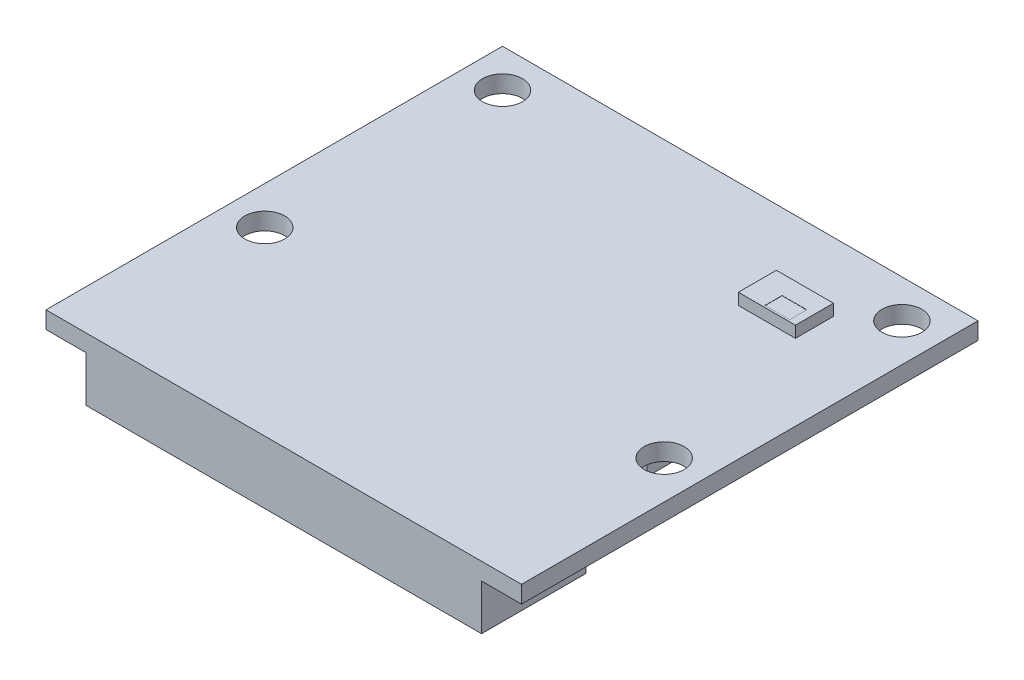
ISO-10303-21;
HEADER;
FILE_DESCRIPTION(('STEP AP214'),'2;1');
FILE_NAME('part.step','',(''),(''),'','','');
FILE_SCHEMA(('AUTOMOTIVE_DESIGN { 1 0 10303 214 1 1 1 1 }'));
ENDSEC;
DATA;
#1=APPLICATION_CONTEXT('core data for automotive mechanical design processes');
#2=APPLICATION_PROTOCOL_DEFINITION('international standard','automotive_design',2000,#1);
#3=PRODUCT_CONTEXT('',#1,'mechanical');
#4=PRODUCT('Part','Part','',(#3));
#5=PRODUCT_RELATED_PRODUCT_CATEGORY('part','',(#4));
#6=PRODUCT_DEFINITION_FORMATION('','',#4);
#7=PRODUCT_DEFINITION_CONTEXT('part definition',#1,'design');
#8=PRODUCT_DEFINITION('design','',#6,#7);
#9=PRODUCT_DEFINITION_SHAPE('','',#8);
#10=(LENGTH_UNIT() NAMED_UNIT(*) SI_UNIT(.MILLI.,.METRE.));
#11=(NAMED_UNIT(*) PLANE_ANGLE_UNIT() SI_UNIT($,.RADIAN.));
#12=(NAMED_UNIT(*) SI_UNIT($,.STERADIAN.) SOLID_ANGLE_UNIT());
#13=UNCERTAINTY_MEASURE_WITH_UNIT(LENGTH_MEASURE(1.E-05),#10,'distance_accuracy_value','');
#14=(GEOMETRIC_REPRESENTATION_CONTEXT(3) GLOBAL_UNCERTAINTY_ASSIGNED_CONTEXT((#13)) GLOBAL_UNIT_ASSIGNED_CONTEXT((#10,
#11,#12)) REPRESENTATION_CONTEXT('',''));
#15=CARTESIAN_POINT('',(0.,0.,0.));
#16=DIRECTION('',(0.,0.,1.));
#17=DIRECTION('',(1.,0.,0.));
#18=AXIS2_PLACEMENT_3D('',#15,#16,#17);
#19=CARTESIAN_POINT('',(0.,0.,0.));
#20=DIRECTION('',(0.,1.,0.));
#21=DIRECTION('',(0.,0.,1.));
#22=AXIS2_PLACEMENT_3D('',#19,#20,#21);
#23=PLANE('',#22);
#24=CARTESIAN_POINT('',(-10.5,0.,-12.5));
#25=DIRECTION('',(0.,1.,0.));
#26=DIRECTION('',(0.,0.,-1.));
#27=AXIS2_PLACEMENT_3D('',#24,#25,#26);
#28=CIRCLE('',#27,1.05);
#29=CARTESIAN_POINT('',(-10.5,0.,-13.55));
#30=VERTEX_POINT('',#29);
#31=EDGE_CURVE('E376',#30,#30,#28,.T.);
#32=ORIENTED_EDGE('',*,*,#31,.F.);
#33=EDGE_LOOP('',(#32));
#34=FACE_BOUND('',#33,.T.);
#35=CARTESIAN_POINT('',(-10.5,0.,0.));
#36=DIRECTION('',(0.,1.,0.));
#37=DIRECTION('',(0.,0.,-1.));
#38=AXIS2_PLACEMENT_3D('',#35,#36,#37);
#39=CIRCLE('',#38,1.05);
#40=CARTESIAN_POINT('',(-10.5,0.,-1.05));
#41=VERTEX_POINT('',#40);
#42=EDGE_CURVE('E382',#41,#41,#39,.T.);
#43=ORIENTED_EDGE('',*,*,#42,.F.);
#44=EDGE_LOOP('',(#43));
#45=FACE_BOUND('',#44,.T.);
#46=CARTESIAN_POINT('',(10.5,0.,0.));
#47=DIRECTION('',(0.,1.,0.));
#48=DIRECTION('',(0.,0.,1.));
#49=AXIS2_PLACEMENT_3D('',#46,#47,#48);
#50=CIRCLE('',#49,1.05);
#51=CARTESIAN_POINT('',(10.5,0.,1.05));
#52=VERTEX_POINT('',#51);
#53=EDGE_CURVE('E387',#52,#52,#50,.T.);
#54=ORIENTED_EDGE('',*,*,#53,.F.);
#55=EDGE_LOOP('',(#54));
#56=FACE_BOUND('',#55,.T.);
#57=CARTESIAN_POINT('',(10.5,0.,-12.5));
#58=DIRECTION('',(0.,1.,0.));
#59=DIRECTION('',(0.,0.,1.));
#60=AXIS2_PLACEMENT_3D('',#57,#58,#59);
#61=CIRCLE('',#60,1.05);
#62=CARTESIAN_POINT('',(10.5,0.,-11.45));
#63=VERTEX_POINT('',#62);
#64=EDGE_CURVE('E393',#63,#63,#61,.T.);
#65=ORIENTED_EDGE('',*,*,#64,.F.);
#66=EDGE_LOOP('',(#65));
#67=FACE_BOUND('',#66,.T.);
#68=DIRECTION('',(0.,0.,1.));
#69=VECTOR('',#68,1.);
#70=CARTESIAN_POINT('',(-12.5,0.,-14.5));
#71=LINE('',#70,#69);
#72=CARTESIAN_POINT('',(-12.5,0.,-14.5));
#73=VERTEX_POINT('',#72);
#74=CARTESIAN_POINT('',(-12.5,0.,9.5));
#75=VERTEX_POINT('',#74);
#76=EDGE_CURVE('E330',#73,#75,#71,.T.);
#77=ORIENTED_EDGE('',*,*,#76,.T.);
#78=DIRECTION('',(1.,0.,0.));
#79=VECTOR('',#78,1.);
#80=CARTESIAN_POINT('',(-12.5,0.,9.5));
#81=LINE('',#80,#79);
#82=CARTESIAN_POINT('',(12.5,0.,9.5));
#83=VERTEX_POINT('',#82);
#84=EDGE_CURVE('E333',#75,#83,#81,.T.);
#85=ORIENTED_EDGE('',*,*,#84,.T.);
#86=DIRECTION('',(0.,0.,-1.));
#87=VECTOR('',#86,1.);
#88=CARTESIAN_POINT('',(12.5,0.,-14.5));
#89=LINE('',#88,#87);
#90=CARTESIAN_POINT('',(12.5,0.,-14.5));
#91=VERTEX_POINT('',#90);
#92=EDGE_CURVE('E337',#83,#91,#89,.T.);
#93=ORIENTED_EDGE('',*,*,#92,.T.);
#94=DIRECTION('',(-1.,0.,0.));
#95=VECTOR('',#94,1.);
#96=CARTESIAN_POINT('',(-12.5,0.,-14.5));
#97=LINE('',#96,#95);
#98=EDGE_CURVE('E340',#91,#73,#97,.T.);
#99=ORIENTED_EDGE('',*,*,#98,.T.);
#100=EDGE_LOOP('',(#77,#85,#93,#99));
#101=FACE_BOUND('',#100,.T.);
#102=DIRECTION('',(1.,0.,0.));
#103=VECTOR('',#102,1.);
#104=CARTESIAN_POINT('',(5.5,0.,-8.90000000000001));
#105=LINE('',#104,#103);
#106=CARTESIAN_POINT('',(5.5,0.,-8.90000000000001));
#107=VERTEX_POINT('',#106);
#108=CARTESIAN_POINT('',(8.5,0.,-8.90000000000001));
#109=VERTEX_POINT('',#108);
#110=EDGE_CURVE('E226',#107,#109,#105,.T.);
#111=ORIENTED_EDGE('',*,*,#110,.F.);
#112=DIRECTION('',(0.,0.,1.));
#113=VECTOR('',#112,1.);
#114=CARTESIAN_POINT('',(5.5,0.,-10.9));
#115=LINE('',#114,#113);
#116=CARTESIAN_POINT('',(5.5,0.,-10.9));
#117=VERTEX_POINT('',#116);
#118=EDGE_CURVE('E209',#117,#107,#115,.T.);
#119=ORIENTED_EDGE('',*,*,#118,.F.);
#120=DIRECTION('',(-1.,0.,0.));
#121=VECTOR('',#120,1.);
#122=CARTESIAN_POINT('',(5.5,0.,-10.9));
#123=LINE('',#122,#121);
#124=CARTESIAN_POINT('',(8.5,0.,-10.9));
#125=VERTEX_POINT('',#124);
#126=EDGE_CURVE('E217',#125,#117,#123,.T.);
#127=ORIENTED_EDGE('',*,*,#126,.F.);
#128=DIRECTION('',(0.,0.,-1.));
#129=VECTOR('',#128,1.);
#130=CARTESIAN_POINT('',(8.5,0.,-10.9));
#131=LINE('',#130,#129);
#132=EDGE_CURVE('E228',#109,#125,#131,.T.);
#133=ORIENTED_EDGE('',*,*,#132,.F.);
#134=EDGE_LOOP('',(#111,#119,#127,#133));
#135=FACE_BOUND('',#134,.T.);
#136=ADVANCED_FACE('F35',(#34,#45,#56,#67,#101,#135),#23,.T.);
#137=CARTESIAN_POINT('',(0.,-0.9,0.));
#138=DIRECTION('',(0.,1.,0.));
#139=DIRECTION('',(0.,0.,1.));
#140=AXIS2_PLACEMENT_3D('',#137,#138,#139);
#141=PLANE('',#140);
#142=DIRECTION('',(0.,0.,-1.));
#143=VECTOR('',#142,1.);
#144=CARTESIAN_POINT('',(-10.4,-0.9,9.5));
#145=LINE('',#144,#143);
#146=CARTESIAN_POINT('',(-10.4,-0.9,9.5));
#147=VERTEX_POINT('',#146);
#148=CARTESIAN_POINT('',(-10.4,-0.9,4.));
#149=VERTEX_POINT('',#148);
#150=EDGE_CURVE('E272',#147,#149,#145,.T.);
#151=ORIENTED_EDGE('',*,*,#150,.F.);
#152=DIRECTION('',(1.,0.,0.));
#153=VECTOR('',#152,1.);
#154=CARTESIAN_POINT('',(-12.5,-0.9,9.5));
#155=LINE('',#154,#153);
#156=CARTESIAN_POINT('',(-12.5,-0.9,9.5));
#157=VERTEX_POINT('',#156);
#158=EDGE_CURVE('E315',#157,#147,#155,.T.);
#159=ORIENTED_EDGE('',*,*,#158,.F.);
#160=DIRECTION('',(0.,0.,1.));
#161=VECTOR('',#160,1.);
#162=CARTESIAN_POINT('',(-12.5,-0.9,-14.5));
#163=LINE('',#162,#161);
#164=CARTESIAN_POINT('',(-12.5,-0.9,-14.5));
#165=VERTEX_POINT('',#164);
#166=EDGE_CURVE('E316',#165,#157,#163,.T.);
#167=ORIENTED_EDGE('',*,*,#166,.F.);
#168=DIRECTION('',(-1.,0.,0.));
#169=VECTOR('',#168,1.);
#170=CARTESIAN_POINT('',(-12.5,-0.9,-14.5));
#171=LINE('',#170,#169);
#172=CARTESIAN_POINT('',(12.5,-0.9,-14.5));
#173=VERTEX_POINT('',#172);
#174=EDGE_CURVE('E326',#173,#165,#171,.T.);
#175=ORIENTED_EDGE('',*,*,#174,.F.);
#176=DIRECTION('',(0.,0.,-1.));
#177=VECTOR('',#176,1.);
#178=CARTESIAN_POINT('',(12.5,-0.9,-14.5));
#179=LINE('',#178,#177);
#180=CARTESIAN_POINT('',(12.5,-0.9,9.5));
#181=VERTEX_POINT('',#180);
#182=EDGE_CURVE('E322',#181,#173,#179,.T.);
#183=ORIENTED_EDGE('',*,*,#182,.F.);
#184=CARTESIAN_POINT('',(10.4,-0.9,9.5));
#185=VERTEX_POINT('',#184);
#186=EDGE_CURVE('E312',#185,#181,#155,.T.);
#187=ORIENTED_EDGE('',*,*,#186,.F.);
#188=DIRECTION('',(0.,0.,1.));
#189=VECTOR('',#188,1.);
#190=CARTESIAN_POINT('',(10.4,-0.9,9.5));
#191=LINE('',#190,#189);
#192=CARTESIAN_POINT('',(10.4,-0.9,4.));
#193=VERTEX_POINT('',#192);
#194=EDGE_CURVE('E277',#193,#185,#191,.T.);
#195=ORIENTED_EDGE('',*,*,#194,.F.);
#196=DIRECTION('',(1.,0.,0.));
#197=VECTOR('',#196,1.);
#198=CARTESIAN_POINT('',(-10.4,-0.9,4.));
#199=LINE('',#198,#197);
#200=EDGE_CURVE('E284',#149,#193,#199,.T.);
#201=ORIENTED_EDGE('',*,*,#200,.F.);
#202=EDGE_LOOP('',(#151,#159,#167,#175,#183,#187,#195,#201));
#203=FACE_BOUND('',#202,.T.);
#204=CARTESIAN_POINT('',(-10.5,-0.9,-12.5));
#205=DIRECTION('',(0.,1.,0.));
#206=DIRECTION('',(0.,0.,-1.));
#207=AXIS2_PLACEMENT_3D('',#204,#205,#206);
#208=CIRCLE('',#207,1.05);
#209=CARTESIAN_POINT('',(-10.5,-0.9,-13.55));
#210=VERTEX_POINT('',#209);
#211=EDGE_CURVE('E378',#210,#210,#208,.T.);
#212=ORIENTED_EDGE('',*,*,#211,.T.);
#213=EDGE_LOOP('',(#212));
#214=FACE_BOUND('',#213,.T.);
#215=CARTESIAN_POINT('',(-10.5,-0.9,0.));
#216=DIRECTION('',(0.,1.,0.));
#217=DIRECTION('',(0.,0.,-1.));
#218=AXIS2_PLACEMENT_3D('',#215,#216,#217);
#219=CIRCLE('',#218,1.05);
#220=CARTESIAN_POINT('',(-10.5,-0.9,-1.05));
#221=VERTEX_POINT('',#220);
#222=EDGE_CURVE('E384',#221,#221,#219,.T.);
#223=ORIENTED_EDGE('',*,*,#222,.T.);
#224=EDGE_LOOP('',(#223));
#225=FACE_BOUND('',#224,.T.);
#226=CARTESIAN_POINT('',(10.5,-0.9,0.));
#227=DIRECTION('',(0.,1.,0.));
#228=DIRECTION('',(0.,0.,1.));
#229=AXIS2_PLACEMENT_3D('',#226,#227,#228);
#230=CIRCLE('',#229,1.05);
#231=CARTESIAN_POINT('',(10.5,-0.9,1.05));
#232=VERTEX_POINT('',#231);
#233=EDGE_CURVE('E390',#232,#232,#230,.T.);
#234=ORIENTED_EDGE('',*,*,#233,.T.);
#235=EDGE_LOOP('',(#234));
#236=FACE_BOUND('',#235,.T.);
#237=CARTESIAN_POINT('',(10.5,-0.9,-12.5));
#238=DIRECTION('',(0.,1.,0.));
#239=DIRECTION('',(0.,0.,1.));
#240=AXIS2_PLACEMENT_3D('',#237,#238,#239);
#241=CIRCLE('',#240,1.05);
#242=CARTESIAN_POINT('',(10.5,-0.9,-11.45));
#243=VERTEX_POINT('',#242);
#244=EDGE_CURVE('E334',#243,#243,#241,.T.);
#245=ORIENTED_EDGE('',*,*,#244,.T.);
#246=EDGE_LOOP('',(#245));
#247=FACE_BOUND('',#246,.T.);
#248=DIRECTION('',(0.,0.,-1.));
#249=VECTOR('',#248,1.);
#250=CARTESIAN_POINT('',(-9.,-0.9,-0.900000000000005));
#251=LINE('',#250,#249);
#252=CARTESIAN_POINT('',(-9.,-0.9,-0.900000000000005));
#253=VERTEX_POINT('',#252);
#254=CARTESIAN_POINT('',(-9.,-0.9,-12.5));
#255=VERTEX_POINT('',#254);
#256=EDGE_CURVE('E239',#253,#255,#251,.T.);
#257=ORIENTED_EDGE('',*,*,#256,.F.);
#258=DIRECTION('',(-1.,0.,0.));
#259=VECTOR('',#258,1.);
#260=CARTESIAN_POINT('',(-9.,-0.9,-0.900000000000005));
#261=LINE('',#260,#259);
#262=CARTESIAN_POINT('',(8.7,-0.9,-0.900000000000005));
#263=VERTEX_POINT('',#262);
#264=EDGE_CURVE('E244',#263,#253,#261,.T.);
#265=ORIENTED_EDGE('',*,*,#264,.F.);
#266=DIRECTION('',(0.,0.,1.));
#267=VECTOR('',#266,1.);
#268=CARTESIAN_POINT('',(8.7,-0.9,-0.900000000000005));
#269=LINE('',#268,#267);
#270=CARTESIAN_POINT('',(8.7,-0.9,-12.5));
#271=VERTEX_POINT('',#270);
#272=EDGE_CURVE('E256',#271,#263,#269,.T.);
#273=ORIENTED_EDGE('',*,*,#272,.F.);
#274=DIRECTION('',(1.,0.,0.));
#275=VECTOR('',#274,1.);
#276=CARTESIAN_POINT('',(-9.,-0.9,-12.5));
#277=LINE('',#276,#275);
#278=EDGE_CURVE('E253',#255,#271,#277,.T.);
#279=ORIENTED_EDGE('',*,*,#278,.F.);
#280=EDGE_LOOP('',(#257,#265,#273,#279));
#281=FACE_BOUND('',#280,.T.);
#282=ADVANCED_FACE('F362',(#203,#214,#225,#236,#247,#281),#141,.F.);
#283=CARTESIAN_POINT('',(-12.5,-0.9,-14.5));
#284=DIRECTION('',(-1.,0.,0.));
#285=DIRECTION('',(0.,0.,1.));
#286=AXIS2_PLACEMENT_3D('',#283,#284,#285);
#287=PLANE('',#286);
#288=ORIENTED_EDGE('',*,*,#76,.F.);
#289=DIRECTION('',(0.,1.,0.));
#290=VECTOR('',#289,1.);
#291=CARTESIAN_POINT('',(-12.5,-0.9,-14.5));
#292=LINE('',#291,#290);
#293=EDGE_CURVE('E11',#165,#73,#292,.T.);
#294=ORIENTED_EDGE('',*,*,#293,.F.);
#295=ORIENTED_EDGE('',*,*,#166,.T.);
#296=DIRECTION('',(0.,1.,0.));
#297=VECTOR('',#296,1.);
#298=CARTESIAN_POINT('',(-12.5,-0.9,9.5));
#299=LINE('',#298,#297);
#300=EDGE_CURVE('E329',#157,#75,#299,.T.);
#301=ORIENTED_EDGE('',*,*,#300,.T.);
#302=EDGE_LOOP('',(#288,#294,#295,#301));
#303=FACE_BOUND('',#302,.T.);
#304=ADVANCED_FACE('F37',(#303),#287,.T.);
#305=CARTESIAN_POINT('',(-12.5,-0.9,-14.5));
#306=DIRECTION('',(0.,0.,-1.));
#307=DIRECTION('',(-1.,0.,0.));
#308=AXIS2_PLACEMENT_3D('',#305,#306,#307);
#309=PLANE('',#308);
#310=ORIENTED_EDGE('',*,*,#98,.F.);
#311=DIRECTION('',(0.,1.,0.));
#312=VECTOR('',#311,1.);
#313=CARTESIAN_POINT('',(12.5,-0.9,-14.5));
#314=LINE('',#313,#312);
#315=EDGE_CURVE('E44',#173,#91,#314,.T.);
#316=ORIENTED_EDGE('',*,*,#315,.F.);
#317=ORIENTED_EDGE('',*,*,#174,.T.);
#318=ORIENTED_EDGE('',*,*,#293,.T.);
#319=EDGE_LOOP('',(#310,#316,#317,#318));
#320=FACE_BOUND('',#319,.T.);
#321=ADVANCED_FACE('F359',(#320),#309,.T.);
#322=CARTESIAN_POINT('',(12.5,-0.9,-14.5));
#323=DIRECTION('',(1.,0.,0.));
#324=DIRECTION('',(0.,0.,-1.));
#325=AXIS2_PLACEMENT_3D('',#322,#323,#324);
#326=PLANE('',#325);
#327=ORIENTED_EDGE('',*,*,#92,.F.);
#328=DIRECTION('',(0.,1.,0.));
#329=VECTOR('',#328,1.);
#330=CARTESIAN_POINT('',(12.5,-0.9,9.5));
#331=LINE('',#330,#329);
#332=EDGE_CURVE('E344',#181,#83,#331,.T.);
#333=ORIENTED_EDGE('',*,*,#332,.F.);
#334=ORIENTED_EDGE('',*,*,#182,.T.);
#335=ORIENTED_EDGE('',*,*,#315,.T.);
#336=EDGE_LOOP('',(#327,#333,#334,#335));
#337=FACE_BOUND('',#336,.T.);
#338=ADVANCED_FACE('F417',(#337),#326,.T.);
#339=CARTESIAN_POINT('',(-12.5,-0.9,9.5));
#340=DIRECTION('',(0.,0.,1.));
#341=DIRECTION('',(1.,0.,0.));
#342=AXIS2_PLACEMENT_3D('',#339,#340,#341);
#343=PLANE('',#342);
#344=ORIENTED_EDGE('',*,*,#84,.F.);
#345=ORIENTED_EDGE('',*,*,#300,.F.);
#346=ORIENTED_EDGE('',*,*,#158,.T.);
#347=DIRECTION('',(0.,1.,0.));
#348=VECTOR('',#347,1.);
#349=CARTESIAN_POINT('',(-10.4,-3.3,9.5));
#350=LINE('',#349,#348);
#351=CARTESIAN_POINT('',(-10.4,-3.3,9.5));
#352=VERTEX_POINT('',#351);
#353=EDGE_CURVE('E283',#352,#147,#350,.T.);
#354=ORIENTED_EDGE('',*,*,#353,.F.);
#355=DIRECTION('',(-1.,0.,0.));
#356=VECTOR('',#355,1.);
#357=CARTESIAN_POINT('',(-10.4,-3.3,9.5));
#358=LINE('',#357,#356);
#359=CARTESIAN_POINT('',(10.4,-3.3,9.5));
#360=VERTEX_POINT('',#359);
#361=EDGE_CURVE('E281',#360,#352,#358,.T.);
#362=ORIENTED_EDGE('',*,*,#361,.F.);
#363=DIRECTION('',(0.,1.,0.));
#364=VECTOR('',#363,1.);
#365=CARTESIAN_POINT('',(10.4,-3.3,9.5));
#366=LINE('',#365,#364);
#367=EDGE_CURVE('E296',#360,#185,#366,.T.);
#368=ORIENTED_EDGE('',*,*,#367,.T.);
#369=ORIENTED_EDGE('',*,*,#186,.T.);
#370=ORIENTED_EDGE('',*,*,#332,.T.);
#371=EDGE_LOOP('',(#344,#345,#346,#354,#362,#368,#369,#370));
#372=FACE_BOUND('',#371,.T.);
#373=ADVANCED_FACE('F352',(#372),#343,.T.);
#374=CARTESIAN_POINT('',(10.5,-0.9,-12.5));
#375=DIRECTION('',(0.,1.,0.));
#376=DIRECTION('',(0.,0.,1.));
#377=AXIS2_PLACEMENT_3D('',#374,#375,#376);
#378=CYLINDRICAL_SURFACE('',#377,1.05);
#379=ORIENTED_EDGE('',*,*,#244,.F.);
#380=EDGE_LOOP('',(#379));
#381=FACE_BOUND('',#380,.T.);
#382=ORIENTED_EDGE('',*,*,#64,.T.);
#383=EDGE_LOOP('',(#382));
#384=FACE_BOUND('',#383,.T.);
#385=ADVANCED_FACE('F400',(#381,#384),#378,.F.);
#386=CARTESIAN_POINT('',(10.5,-0.9,0.));
#387=DIRECTION('',(0.,1.,0.));
#388=DIRECTION('',(0.,0.,1.));
#389=AXIS2_PLACEMENT_3D('',#386,#387,#388);
#390=CYLINDRICAL_SURFACE('',#389,1.05);
#391=ORIENTED_EDGE('',*,*,#233,.F.);
#392=EDGE_LOOP('',(#391));
#393=FACE_BOUND('',#392,.T.);
#394=ORIENTED_EDGE('',*,*,#53,.T.);
#395=EDGE_LOOP('',(#394));
#396=FACE_BOUND('',#395,.T.);
#397=ADVANCED_FACE('F426',(#393,#396),#390,.F.);
#398=CARTESIAN_POINT('',(-10.5,-0.9,0.));
#399=DIRECTION('',(0.,1.,0.));
#400=DIRECTION('',(0.,0.,1.));
#401=AXIS2_PLACEMENT_3D('',#398,#399,#400);
#402=CYLINDRICAL_SURFACE('',#401,1.05);
#403=ORIENTED_EDGE('',*,*,#222,.F.);
#404=EDGE_LOOP('',(#403));
#405=FACE_BOUND('',#404,.T.);
#406=ORIENTED_EDGE('',*,*,#42,.T.);
#407=EDGE_LOOP('',(#406));
#408=FACE_BOUND('',#407,.T.);
#409=ADVANCED_FACE('F431',(#405,#408),#402,.F.);
#410=CARTESIAN_POINT('',(-10.5,-0.9,-12.5));
#411=DIRECTION('',(0.,1.,0.));
#412=DIRECTION('',(0.,0.,1.));
#413=AXIS2_PLACEMENT_3D('',#410,#411,#412);
#414=CYLINDRICAL_SURFACE('',#413,1.05);
#415=ORIENTED_EDGE('',*,*,#211,.F.);
#416=EDGE_LOOP('',(#415));
#417=FACE_BOUND('',#416,.T.);
#418=ORIENTED_EDGE('',*,*,#31,.T.);
#419=EDGE_LOOP('',(#418));
#420=FACE_BOUND('',#419,.T.);
#421=ADVANCED_FACE('F438',(#417,#420),#414,.F.);
#422=CARTESIAN_POINT('',(-10.4,-3.3,9.5));
#423=DIRECTION('',(1.,0.,0.));
#424=DIRECTION('',(0.,0.,-1.));
#425=AXIS2_PLACEMENT_3D('',#422,#423,#424);
#426=PLANE('',#425);
#427=ORIENTED_EDGE('',*,*,#150,.T.);
#428=DIRECTION('',(0.,1.,0.));
#429=VECTOR('',#428,1.);
#430=CARTESIAN_POINT('',(-10.4,-3.3,4.));
#431=LINE('',#430,#429);
#432=CARTESIAN_POINT('',(-10.4,-3.3,4.));
#433=VERTEX_POINT('',#432);
#434=EDGE_CURVE('E302',#433,#149,#431,.T.);
#435=ORIENTED_EDGE('',*,*,#434,.F.);
#436=DIRECTION('',(0.,0.,-1.));
#437=VECTOR('',#436,1.);
#438=CARTESIAN_POINT('',(-10.4,-3.3,9.5));
#439=LINE('',#438,#437);
#440=EDGE_CURVE('E273',#352,#433,#439,.T.);
#441=ORIENTED_EDGE('',*,*,#440,.F.);
#442=ORIENTED_EDGE('',*,*,#353,.T.);
#443=EDGE_LOOP('',(#427,#435,#441,#442));
#444=FACE_BOUND('',#443,.T.);
#445=ADVANCED_FACE('F366',(#444),#426,.F.);
#446=CARTESIAN_POINT('',(-10.4,-3.3,4.));
#447=DIRECTION('',(0.,0.,1.));
#448=DIRECTION('',(1.,0.,0.));
#449=AXIS2_PLACEMENT_3D('',#446,#447,#448);
#450=PLANE('',#449);
#451=ORIENTED_EDGE('',*,*,#200,.T.);
#452=DIRECTION('',(0.,1.,0.));
#453=VECTOR('',#452,1.);
#454=CARTESIAN_POINT('',(10.4,-3.3,4.));
#455=LINE('',#454,#453);
#456=CARTESIAN_POINT('',(10.4,-3.3,4.));
#457=VERTEX_POINT('',#456);
#458=EDGE_CURVE('E289',#457,#193,#455,.T.);
#459=ORIENTED_EDGE('',*,*,#458,.F.);
#460=DIRECTION('',(1.,0.,0.));
#461=VECTOR('',#460,1.);
#462=CARTESIAN_POINT('',(-10.4,-3.3,4.));
#463=LINE('',#462,#461);
#464=EDGE_CURVE('E276',#433,#457,#463,.T.);
#465=ORIENTED_EDGE('',*,*,#464,.F.);
#466=ORIENTED_EDGE('',*,*,#434,.T.);
#467=EDGE_LOOP('',(#451,#459,#465,#466));
#468=FACE_BOUND('',#467,.T.);
#469=ADVANCED_FACE('F375',(#468),#450,.F.);
#470=CARTESIAN_POINT('',(10.4,-3.3,9.5));
#471=DIRECTION('',(-1.,0.,0.));
#472=DIRECTION('',(0.,0.,1.));
#473=AXIS2_PLACEMENT_3D('',#470,#471,#472);
#474=PLANE('',#473);
#475=ORIENTED_EDGE('',*,*,#194,.T.);
#476=ORIENTED_EDGE('',*,*,#367,.F.);
#477=DIRECTION('',(0.,0.,1.));
#478=VECTOR('',#477,1.);
#479=CARTESIAN_POINT('',(10.4,-3.3,9.5));
#480=LINE('',#479,#478);
#481=EDGE_CURVE('E279',#457,#360,#480,.T.);
#482=ORIENTED_EDGE('',*,*,#481,.F.);
#483=ORIENTED_EDGE('',*,*,#458,.T.);
#484=EDGE_LOOP('',(#475,#476,#482,#483));
#485=FACE_BOUND('',#484,.T.);
#486=ADVANCED_FACE('F373',(#485),#474,.F.);
#487=CARTESIAN_POINT('',(0.,-3.3,0.));
#488=DIRECTION('',(0.,-1.,0.));
#489=DIRECTION('',(0.,0.,-1.));
#490=AXIS2_PLACEMENT_3D('',#487,#488,#489);
#491=PLANE('',#490);
#492=ORIENTED_EDGE('',*,*,#440,.T.);
#493=ORIENTED_EDGE('',*,*,#464,.T.);
#494=ORIENTED_EDGE('',*,*,#481,.T.);
#495=ORIENTED_EDGE('',*,*,#361,.T.);
#496=EDGE_LOOP('',(#492,#493,#494,#495));
#497=FACE_BOUND('',#496,.T.);
#498=ADVANCED_FACE('F369',(#497),#491,.T.);
#499=CARTESIAN_POINT('',(-9.,-2.2,-0.900000000000005));
#500=DIRECTION('',(1.,0.,0.));
#501=DIRECTION('',(0.,0.,-1.));
#502=AXIS2_PLACEMENT_3D('',#499,#500,#501);
#503=PLANE('',#502);
#504=ORIENTED_EDGE('',*,*,#256,.T.);
#505=DIRECTION('',(0.,1.,0.));
#506=VECTOR('',#505,1.);
#507=CARTESIAN_POINT('',(-9.,-2.2,-12.5));
#508=LINE('',#507,#506);
#509=CARTESIAN_POINT('',(-9.,-2.2,-12.5));
#510=VERTEX_POINT('',#509);
#511=EDGE_CURVE('E269',#510,#255,#508,.T.);
#512=ORIENTED_EDGE('',*,*,#511,.F.);
#513=DIRECTION('',(0.,0.,-1.));
#514=VECTOR('',#513,1.);
#515=CARTESIAN_POINT('',(-9.,-2.2,-0.900000000000005));
#516=LINE('',#515,#514);
#517=CARTESIAN_POINT('',(-9.,-2.2,-0.900000000000005));
#518=VERTEX_POINT('',#517);
#519=EDGE_CURVE('E240',#518,#510,#516,.T.);
#520=ORIENTED_EDGE('',*,*,#519,.F.);
#521=DIRECTION('',(0.,1.,0.));
#522=VECTOR('',#521,1.);
#523=CARTESIAN_POINT('',(-9.,-2.2,-0.900000000000005));
#524=LINE('',#523,#522);
#525=EDGE_CURVE('E250',#518,#253,#524,.T.);
#526=ORIENTED_EDGE('',*,*,#525,.T.);
#527=EDGE_LOOP('',(#504,#512,#520,#526));
#528=FACE_BOUND('',#527,.T.);
#529=ADVANCED_FACE('F450',(#528),#503,.F.);
#530=CARTESIAN_POINT('',(-9.,-2.2,-12.5));
#531=DIRECTION('',(0.,0.,1.));
#532=DIRECTION('',(1.,0.,0.));
#533=AXIS2_PLACEMENT_3D('',#530,#531,#532);
#534=PLANE('',#533);
#535=ORIENTED_EDGE('',*,*,#278,.T.);
#536=DIRECTION('',(0.,1.,0.));
#537=VECTOR('',#536,1.);
#538=CARTESIAN_POINT('',(8.7,-2.2,-12.5));
#539=LINE('',#538,#537);
#540=CARTESIAN_POINT('',(8.7,-2.2,-12.5));
#541=VERTEX_POINT('',#540);
#542=EDGE_CURVE('E266',#541,#271,#539,.T.);
#543=ORIENTED_EDGE('',*,*,#542,.F.);
#544=DIRECTION('',(1.,0.,0.));
#545=VECTOR('',#544,1.);
#546=CARTESIAN_POINT('',(-9.,-2.2,-12.5));
#547=LINE('',#546,#545);
#548=EDGE_CURVE('E243',#510,#541,#547,.T.);
#549=ORIENTED_EDGE('',*,*,#548,.F.);
#550=ORIENTED_EDGE('',*,*,#511,.T.);
#551=EDGE_LOOP('',(#535,#543,#549,#550));
#552=FACE_BOUND('',#551,.T.);
#553=ADVANCED_FACE('F453',(#552),#534,.F.);
#554=CARTESIAN_POINT('',(8.7,-2.2,-0.900000000000005));
#555=DIRECTION('',(-1.,0.,0.));
#556=DIRECTION('',(0.,0.,1.));
#557=AXIS2_PLACEMENT_3D('',#554,#555,#556);
#558=PLANE('',#557);
#559=ORIENTED_EDGE('',*,*,#272,.T.);
#560=DIRECTION('',(0.,1.,0.));
#561=VECTOR('',#560,1.);
#562=CARTESIAN_POINT('',(8.7,-2.2,-0.900000000000005));
#563=LINE('',#562,#561);
#564=CARTESIAN_POINT('',(8.7,-2.2,-0.900000000000005));
#565=VERTEX_POINT('',#564);
#566=EDGE_CURVE('E263',#565,#263,#563,.T.);
#567=ORIENTED_EDGE('',*,*,#566,.F.);
#568=DIRECTION('',(0.,0.,1.));
#569=VECTOR('',#568,1.);
#570=CARTESIAN_POINT('',(8.7,-2.2,-0.900000000000005));
#571=LINE('',#570,#569);
#572=EDGE_CURVE('E246',#541,#565,#571,.T.);
#573=ORIENTED_EDGE('',*,*,#572,.F.);
#574=ORIENTED_EDGE('',*,*,#542,.T.);
#575=EDGE_LOOP('',(#559,#567,#573,#574));
#576=FACE_BOUND('',#575,.T.);
#577=ADVANCED_FACE('F457',(#576),#558,.F.);
#578=CARTESIAN_POINT('',(-9.,-2.2,-0.900000000000005));
#579=DIRECTION('',(0.,0.,-1.));
#580=DIRECTION('',(-1.,0.,0.));
#581=AXIS2_PLACEMENT_3D('',#578,#579,#580);
#582=PLANE('',#581);
#583=ORIENTED_EDGE('',*,*,#264,.T.);
#584=ORIENTED_EDGE('',*,*,#525,.F.);
#585=DIRECTION('',(-1.,0.,0.));
#586=VECTOR('',#585,1.);
#587=CARTESIAN_POINT('',(-9.,-2.2,-0.900000000000005));
#588=LINE('',#587,#586);
#589=EDGE_CURVE('E248',#565,#518,#588,.T.);
#590=ORIENTED_EDGE('',*,*,#589,.F.);
#591=ORIENTED_EDGE('',*,*,#566,.T.);
#592=EDGE_LOOP('',(#583,#584,#590,#591));
#593=FACE_BOUND('',#592,.T.);
#594=ADVANCED_FACE('F461',(#593),#582,.F.);
#595=CARTESIAN_POINT('',(0.,-2.2,0.));
#596=DIRECTION('',(0.,-1.,0.));
#597=DIRECTION('',(0.,0.,-1.));
#598=AXIS2_PLACEMENT_3D('',#595,#596,#597);
#599=PLANE('',#598);
#600=ORIENTED_EDGE('',*,*,#519,.T.);
#601=ORIENTED_EDGE('',*,*,#548,.T.);
#602=ORIENTED_EDGE('',*,*,#572,.T.);
#603=ORIENTED_EDGE('',*,*,#589,.T.);
#604=EDGE_LOOP('',(#600,#601,#602,#603));
#605=FACE_BOUND('',#604,.T.);
#606=ADVANCED_FACE('F465',(#605),#599,.T.);
#607=CARTESIAN_POINT('',(5.5,0.6,-10.9));
#608=DIRECTION('',(1.,0.,0.));
#609=DIRECTION('',(0.,0.,-1.));
#610=AXIS2_PLACEMENT_3D('',#607,#608,#609);
#611=PLANE('',#610);
#612=ORIENTED_EDGE('',*,*,#118,.T.);
#613=DIRECTION('',(0.,-1.,0.));
#614=VECTOR('',#613,1.);
#615=CARTESIAN_POINT('',(5.5,0.6,-8.90000000000001));
#616=LINE('',#615,#614);
#617=CARTESIAN_POINT('',(5.5,0.6,-8.90000000000001));
#618=VERTEX_POINT('',#617);
#619=EDGE_CURVE('E237',#618,#107,#616,.T.);
#620=ORIENTED_EDGE('',*,*,#619,.F.);
#621=DIRECTION('',(0.,0.,1.));
#622=VECTOR('',#621,1.);
#623=CARTESIAN_POINT('',(5.5,0.6,-10.9));
#624=LINE('',#623,#622);
#625=CARTESIAN_POINT('',(5.5,0.6,-10.9));
#626=VERTEX_POINT('',#625);
#627=EDGE_CURVE('E213',#626,#618,#624,.T.);
#628=ORIENTED_EDGE('',*,*,#627,.F.);
#629=DIRECTION('',(0.,-1.,0.));
#630=VECTOR('',#629,1.);
#631=CARTESIAN_POINT('',(5.5,0.6,-10.9));
#632=LINE('',#631,#630);
#633=EDGE_CURVE('E223',#626,#117,#632,.T.);
#634=ORIENTED_EDGE('',*,*,#633,.T.);
#635=EDGE_LOOP('',(#612,#620,#628,#634));
#636=FACE_BOUND('',#635,.T.);
#637=ADVANCED_FACE('F469',(#636),#611,.F.);
#638=CARTESIAN_POINT('',(5.5,0.6,-8.90000000000001));
#639=DIRECTION('',(0.,0.,-1.));
#640=DIRECTION('',(-1.,0.,0.));
#641=AXIS2_PLACEMENT_3D('',#638,#639,#640);
#642=PLANE('',#641);
#643=ORIENTED_EDGE('',*,*,#110,.T.);
#644=DIRECTION('',(0.,-1.,0.));
#645=VECTOR('',#644,1.);
#646=CARTESIAN_POINT('',(8.5,0.6,-8.90000000000001));
#647=LINE('',#646,#645);
#648=CARTESIAN_POINT('',(8.5,0.6,-8.90000000000001));
#649=VERTEX_POINT('',#648);
#650=EDGE_CURVE('E234',#649,#109,#647,.T.);
#651=ORIENTED_EDGE('',*,*,#650,.F.);
#652=DIRECTION('',(1.,0.,0.));
#653=VECTOR('',#652,1.);
#654=CARTESIAN_POINT('',(5.5,0.6,-8.90000000000001));
#655=LINE('',#654,#653);
#656=EDGE_CURVE('E216',#618,#649,#655,.T.);
#657=ORIENTED_EDGE('',*,*,#656,.F.);
#658=ORIENTED_EDGE('',*,*,#619,.T.);
#659=EDGE_LOOP('',(#643,#651,#657,#658));
#660=FACE_BOUND('',#659,.T.);
#661=ADVANCED_FACE('F473',(#660),#642,.F.);
#662=CARTESIAN_POINT('',(8.5,0.6,-10.9));
#663=DIRECTION('',(-1.,0.,0.));
#664=DIRECTION('',(0.,0.,1.));
#665=AXIS2_PLACEMENT_3D('',#662,#663,#664);
#666=PLANE('',#665);
#667=ORIENTED_EDGE('',*,*,#132,.T.);
#668=DIRECTION('',(0.,-1.,0.));
#669=VECTOR('',#668,1.);
#670=CARTESIAN_POINT('',(8.5,0.6,-10.9));
#671=LINE('',#670,#669);
#672=CARTESIAN_POINT('',(8.5,0.6,-10.9));
#673=VERTEX_POINT('',#672);
#674=EDGE_CURVE('E60',#673,#125,#671,.T.);
#675=ORIENTED_EDGE('',*,*,#674,.F.);
#676=DIRECTION('',(0.,0.,-1.));
#677=VECTOR('',#676,1.);
#678=CARTESIAN_POINT('',(8.5,0.6,-10.9));
#679=LINE('',#678,#677);
#680=EDGE_CURVE('E219',#649,#673,#679,.T.);
#681=ORIENTED_EDGE('',*,*,#680,.F.);
#682=ORIENTED_EDGE('',*,*,#650,.T.);
#683=EDGE_LOOP('',(#667,#675,#681,#682));
#684=FACE_BOUND('',#683,.T.);
#685=ADVANCED_FACE('F477',(#684),#666,.F.);
#686=CARTESIAN_POINT('',(5.5,0.6,-10.9));
#687=DIRECTION('',(0.,0.,1.));
#688=DIRECTION('',(1.,0.,0.));
#689=AXIS2_PLACEMENT_3D('',#686,#687,#688);
#690=PLANE('',#689);
#691=ORIENTED_EDGE('',*,*,#126,.T.);
#692=ORIENTED_EDGE('',*,*,#633,.F.);
#693=DIRECTION('',(-1.,0.,0.));
#694=VECTOR('',#693,1.);
#695=CARTESIAN_POINT('',(5.5,0.6,-10.9));
#696=LINE('',#695,#694);
#697=EDGE_CURVE('E221',#673,#626,#696,.T.);
#698=ORIENTED_EDGE('',*,*,#697,.F.);
#699=ORIENTED_EDGE('',*,*,#674,.T.);
#700=EDGE_LOOP('',(#691,#692,#698,#699));
#701=FACE_BOUND('',#700,.T.);
#702=ADVANCED_FACE('F481',(#701),#690,.F.);
#703=CARTESIAN_POINT('',(0.,0.6,0.));
#704=DIRECTION('',(0.,1.,0.));
#705=DIRECTION('',(0.,0.,1.));
#706=AXIS2_PLACEMENT_3D('',#703,#704,#705);
#707=PLANE('',#706);
#708=DIRECTION('',(0.,0.,-1.));
#709=VECTOR('',#708,1.);
#710=CARTESIAN_POINT('',(8.1,0.6,-9.00000000000001));
#711=LINE('',#710,#709);
#712=CARTESIAN_POINT('',(8.1,0.6,-9.00000000000001));
#713=VERTEX_POINT('',#712);
#714=CARTESIAN_POINT('',(8.1,0.6,-9.9));
#715=VERTEX_POINT('',#714);
#716=EDGE_CURVE('E52',#713,#715,#711,.T.);
#717=ORIENTED_EDGE('',*,*,#716,.F.);
#718=DIRECTION('',(1.,0.,0.));
#719=VECTOR('',#718,1.);
#720=CARTESIAN_POINT('',(8.1,0.6,-9.00000000000001));
#721=LINE('',#720,#719);
#722=CARTESIAN_POINT('',(6.8,0.6,-9.00000000000001));
#723=VERTEX_POINT('',#722);
#724=EDGE_CURVE('E194',#723,#713,#721,.T.);
#725=ORIENTED_EDGE('',*,*,#724,.F.);
#726=DIRECTION('',(0.,0.,1.));
#727=VECTOR('',#726,1.);
#728=CARTESIAN_POINT('',(6.8,0.6,-9.00000000000001));
#729=LINE('',#728,#727);
#730=CARTESIAN_POINT('',(6.8,0.6,-9.9));
#731=VERTEX_POINT('',#730);
#732=EDGE_CURVE('E197',#731,#723,#729,.T.);
#733=ORIENTED_EDGE('',*,*,#732,.F.);
#734=DIRECTION('',(-1.,0.,0.));
#735=VECTOR('',#734,1.);
#736=CARTESIAN_POINT('',(8.1,0.6,-9.9));
#737=LINE('',#736,#735);
#738=EDGE_CURVE('E203',#715,#731,#737,.T.);
#739=ORIENTED_EDGE('',*,*,#738,.F.);
#740=EDGE_LOOP('',(#717,#725,#733,#739));
#741=FACE_BOUND('',#740,.T.);
#742=ORIENTED_EDGE('',*,*,#627,.T.);
#743=ORIENTED_EDGE('',*,*,#656,.T.);
#744=ORIENTED_EDGE('',*,*,#680,.T.);
#745=ORIENTED_EDGE('',*,*,#697,.T.);
#746=EDGE_LOOP('',(#742,#743,#744,#745));
#747=FACE_BOUND('',#746,.T.);
#748=ADVANCED_FACE('F485',(#741,#747),#707,.T.);
#749=CARTESIAN_POINT('',(8.1,0.59,-9.00000000000001));
#750=DIRECTION('',(1.,0.,0.));
#751=DIRECTION('',(0.,0.,-1.));
#752=AXIS2_PLACEMENT_3D('',#749,#750,#751);
#753=PLANE('',#752);
#754=ORIENTED_EDGE('',*,*,#716,.T.);
#755=DIRECTION('',(0.,1.,0.));
#756=VECTOR('',#755,1.);
#757=CARTESIAN_POINT('',(8.1,0.59,-9.9));
#758=LINE('',#757,#756);
#759=CARTESIAN_POINT('',(8.1,0.59,-9.9));
#760=VERTEX_POINT('',#759);
#761=EDGE_CURVE('E172',#760,#715,#758,.T.);
#762=ORIENTED_EDGE('',*,*,#761,.F.);
#763=DIRECTION('',(0.,0.,-1.));
#764=VECTOR('',#763,1.);
#765=CARTESIAN_POINT('',(8.1,0.59,-9.00000000000001));
#766=LINE('',#765,#764);
#767=CARTESIAN_POINT('',(8.1,0.59,-9.00000000000001));
#768=VERTEX_POINT('',#767);
#769=EDGE_CURVE('E176',#768,#760,#766,.T.);
#770=ORIENTED_EDGE('',*,*,#769,.F.);
#771=DIRECTION('',(0.,1.,0.));
#772=VECTOR('',#771,1.);
#773=CARTESIAN_POINT('',(8.1,0.59,-9.00000000000001));
#774=LINE('',#773,#772);
#775=EDGE_CURVE('E207',#768,#713,#774,.T.);
#776=ORIENTED_EDGE('',*,*,#775,.T.);
#777=EDGE_LOOP('',(#754,#762,#770,#776));
#778=FACE_BOUND('',#777,.T.);
#779=ADVANCED_FACE('F174',(#778),#753,.F.);
#780=CARTESIAN_POINT('',(8.1,0.59,-9.00000000000001));
#781=DIRECTION('',(0.,0.,1.));
#782=DIRECTION('',(1.,0.,0.));
#783=AXIS2_PLACEMENT_3D('',#780,#781,#782);
#784=PLANE('',#783);
#785=ORIENTED_EDGE('',*,*,#724,.T.);
#786=ORIENTED_EDGE('',*,*,#775,.F.);
#787=DIRECTION('',(1.,0.,0.));
#788=VECTOR('',#787,1.);
#789=CARTESIAN_POINT('',(8.1,0.59,-9.00000000000001));
#790=LINE('',#789,#788);
#791=CARTESIAN_POINT('',(6.8,0.59,-9.00000000000001));
#792=VERTEX_POINT('',#791);
#793=EDGE_CURVE('E182',#792,#768,#790,.T.);
#794=ORIENTED_EDGE('',*,*,#793,.F.);
#795=DIRECTION('',(0.,1.,0.));
#796=VECTOR('',#795,1.);
#797=CARTESIAN_POINT('',(6.8,0.59,-9.00000000000001));
#798=LINE('',#797,#796);
#799=EDGE_CURVE('E210',#792,#723,#798,.T.);
#800=ORIENTED_EDGE('',*,*,#799,.T.);
#801=EDGE_LOOP('',(#785,#786,#794,#800));
#802=FACE_BOUND('',#801,.T.);
#803=ADVANCED_FACE('F491',(#802),#784,.F.);
#804=CARTESIAN_POINT('',(6.8,0.59,-9.00000000000001));
#805=DIRECTION('',(-1.,0.,0.));
#806=DIRECTION('',(0.,0.,1.));
#807=AXIS2_PLACEMENT_3D('',#804,#805,#806);
#808=PLANE('',#807);
#809=ORIENTED_EDGE('',*,*,#732,.T.);
#810=ORIENTED_EDGE('',*,*,#799,.F.);
#811=DIRECTION('',(0.,0.,1.));
#812=VECTOR('',#811,1.);
#813=CARTESIAN_POINT('',(6.8,0.59,-9.00000000000001));
#814=LINE('',#813,#812);
#815=CARTESIAN_POINT('',(6.8,0.59,-9.9));
#816=VERTEX_POINT('',#815);
#817=EDGE_CURVE('E190',#816,#792,#814,.T.);
#818=ORIENTED_EDGE('',*,*,#817,.F.);
#819=DIRECTION('',(0.,1.,0.));
#820=VECTOR('',#819,1.);
#821=CARTESIAN_POINT('',(6.8,0.59,-9.9));
#822=LINE('',#821,#820);
#823=EDGE_CURVE('E181',#816,#731,#822,.T.);
#824=ORIENTED_EDGE('',*,*,#823,.T.);
#825=EDGE_LOOP('',(#809,#810,#818,#824));
#826=FACE_BOUND('',#825,.T.);
#827=ADVANCED_FACE('F494',(#826),#808,.F.);
#828=CARTESIAN_POINT('',(8.1,0.59,-9.9));
#829=DIRECTION('',(0.,0.,-1.));
#830=DIRECTION('',(-1.,0.,0.));
#831=AXIS2_PLACEMENT_3D('',#828,#829,#830);
#832=PLANE('',#831);
#833=ORIENTED_EDGE('',*,*,#738,.T.);
#834=ORIENTED_EDGE('',*,*,#823,.F.);
#835=DIRECTION('',(-1.,0.,0.));
#836=VECTOR('',#835,1.);
#837=CARTESIAN_POINT('',(8.1,0.59,-9.9));
#838=LINE('',#837,#836);
#839=EDGE_CURVE('E185',#760,#816,#838,.T.);
#840=ORIENTED_EDGE('',*,*,#839,.F.);
#841=ORIENTED_EDGE('',*,*,#761,.T.);
#842=EDGE_LOOP('',(#833,#834,#840,#841));
#843=FACE_BOUND('',#842,.T.);
#844=ADVANCED_FACE('F186',(#843),#832,.F.);
#845=CARTESIAN_POINT('',(0.,0.59,0.));
#846=DIRECTION('',(0.,1.,0.));
#847=DIRECTION('',(0.,0.,1.));
#848=AXIS2_PLACEMENT_3D('',#845,#846,#847);
#849=PLANE('',#848);
#850=ORIENTED_EDGE('',*,*,#769,.T.);
#851=ORIENTED_EDGE('',*,*,#839,.T.);
#852=ORIENTED_EDGE('',*,*,#817,.T.);
#853=ORIENTED_EDGE('',*,*,#793,.T.);
#854=EDGE_LOOP('',(#850,#851,#852,#853));
#855=FACE_BOUND('',#854,.T.);
#856=ADVANCED_FACE('F192',(#855),#849,.T.);
#857=CLOSED_SHELL('',(#136,#282,#304,#321,#338,#373,#385,#397,#409,#421,#445,#469,#486,#498,
#529,#553,#577,#594,#606,#637,#661,#685,#702,#748,#779,#803,#827,#844,#856));
#858=MANIFOLD_SOLID_BREP('B2',#857);
#859=ADVANCED_BREP_SHAPE_REPRESENTATION('',(#18,#858),#14);
#860=SHAPE_DEFINITION_REPRESENTATION(#9,#859);
ENDSEC;
END-ISO-10303-21;
